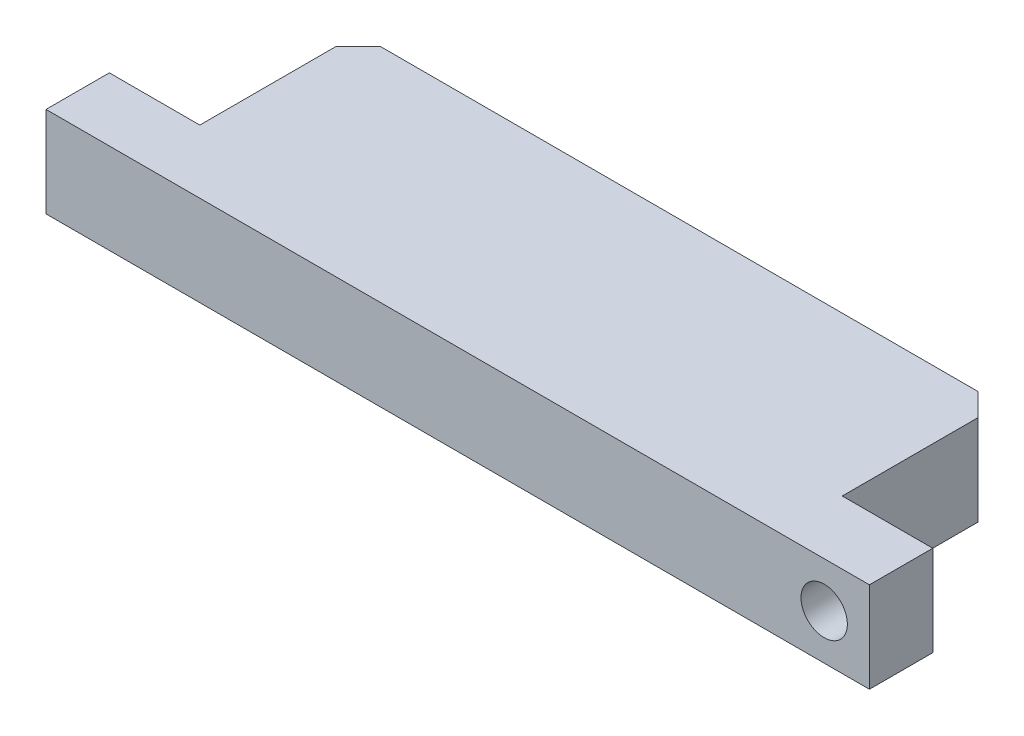
ISO-10303-21;
HEADER;
FILE_DESCRIPTION(('STEP AP214'),'2;1');
FILE_NAME('part.step','',(''),(''),'','','');
FILE_SCHEMA(('AUTOMOTIVE_DESIGN { 1 0 10303 214 1 1 1 1 }'));
ENDSEC;
DATA;
#1=APPLICATION_CONTEXT('core data for automotive mechanical design processes');
#2=APPLICATION_PROTOCOL_DEFINITION('international standard','automotive_design',2000,#1);
#3=PRODUCT_CONTEXT('',#1,'mechanical');
#4=PRODUCT('Part','Part','',(#3));
#5=PRODUCT_RELATED_PRODUCT_CATEGORY('part','',(#4));
#6=PRODUCT_DEFINITION_FORMATION('','',#4);
#7=PRODUCT_DEFINITION_CONTEXT('part definition',#1,'design');
#8=PRODUCT_DEFINITION('design','',#6,#7);
#9=PRODUCT_DEFINITION_SHAPE('','',#8);
#10=(LENGTH_UNIT() NAMED_UNIT(*) SI_UNIT(.MILLI.,.METRE.));
#11=(NAMED_UNIT(*) PLANE_ANGLE_UNIT() SI_UNIT($,.RADIAN.));
#12=(NAMED_UNIT(*) SI_UNIT($,.STERADIAN.) SOLID_ANGLE_UNIT());
#13=UNCERTAINTY_MEASURE_WITH_UNIT(LENGTH_MEASURE(1.E-05),#10,'distance_accuracy_value','');
#14=(GEOMETRIC_REPRESENTATION_CONTEXT(3) GLOBAL_UNCERTAINTY_ASSIGNED_CONTEXT((#13)) GLOBAL_UNIT_ASSIGNED_CONTEXT((#10,
#11,#12)) REPRESENTATION_CONTEXT('',''));
#15=CARTESIAN_POINT('',(0.,0.,0.));
#16=DIRECTION('',(0.,0.,1.));
#17=DIRECTION('',(1.,0.,0.));
#18=AXIS2_PLACEMENT_3D('',#15,#16,#17);
#19=CARTESIAN_POINT('',(18.2,0.,9.8));
#20=DIRECTION('',(1.,0.,0.));
#21=DIRECTION('',(0.,0.,-1.));
#22=AXIS2_PLACEMENT_3D('',#19,#20,#21);
#23=PLANE('',#22);
#24=DIRECTION('',(0.,-1.,0.));
#25=VECTOR('',#24,1.);
#26=CARTESIAN_POINT('',(18.2,4.,6.9999999993));
#27=LINE('',#26,#25);
#28=CARTESIAN_POINT('',(18.2,4.,6.9999999993));
#29=VERTEX_POINT('',#28);
#30=CARTESIAN_POINT('',(18.2,0.,6.9999999993));
#31=VERTEX_POINT('',#30);
#32=EDGE_CURVE('E144',#29,#31,#27,.T.);
#33=ORIENTED_EDGE('',*,*,#32,.F.);
#34=DIRECTION('',(0.,0.,-1.));
#35=VECTOR('',#34,1.);
#36=CARTESIAN_POINT('',(18.2,4.,9.8));
#37=LINE('',#36,#35);
#38=CARTESIAN_POINT('',(18.2,4.,9.8));
#39=VERTEX_POINT('',#38);
#40=EDGE_CURVE('E164',#39,#29,#37,.T.);
#41=ORIENTED_EDGE('',*,*,#40,.F.);
#42=DIRECTION('',(0.,1.,0.));
#43=VECTOR('',#42,1.);
#44=CARTESIAN_POINT('',(18.2,0.,9.8));
#45=LINE('',#44,#43);
#46=CARTESIAN_POINT('',(18.2,0.,9.8));
#47=VERTEX_POINT('',#46);
#48=EDGE_CURVE('E187',#47,#39,#45,.T.);
#49=ORIENTED_EDGE('',*,*,#48,.F.);
#50=DIRECTION('',(0.,0.,-1.));
#51=VECTOR('',#50,1.);
#52=CARTESIAN_POINT('',(18.2,0.,9.8));
#53=LINE('',#52,#51);
#54=EDGE_CURVE('E167',#47,#31,#53,.T.);
#55=ORIENTED_EDGE('',*,*,#54,.T.);
#56=EDGE_LOOP('',(#33,#41,#49,#55));
#57=FACE_BOUND('',#56,.T.);
#58=ADVANCED_FACE('F32',(#57),#23,.T.);
#59=CARTESIAN_POINT('',(-18.2,0.,9.8));
#60=DIRECTION('',(0.,0.,1.));
#61=DIRECTION('',(1.,0.,0.));
#62=AXIS2_PLACEMENT_3D('',#59,#60,#61);
#63=PLANE('',#62);
#64=CARTESIAN_POINT('',(16.2,2.,9.8));
#65=DIRECTION('',(0.,0.,1.));
#66=DIRECTION('',(1.,0.,0.));
#67=AXIS2_PLACEMENT_3D('',#64,#65,#66);
#68=CIRCLE('',#67,1.02499999999998);
#69=CARTESIAN_POINT('',(17.225,2.,9.8));
#70=VERTEX_POINT('',#69);
#71=EDGE_CURVE('E289',#70,#70,#68,.T.);
#72=ORIENTED_EDGE('',*,*,#71,.F.);
#73=EDGE_LOOP('',(#72));
#74=FACE_BOUND('',#73,.T.);
#75=DIRECTION('',(1.,0.,0.));
#76=VECTOR('',#75,1.);
#77=CARTESIAN_POINT('',(-18.2,4.,9.8));
#78=LINE('',#77,#76);
#79=CARTESIAN_POINT('',(-18.2,4.,9.8));
#80=VERTEX_POINT('',#79);
#81=EDGE_CURVE('E171',#80,#39,#78,.T.);
#82=ORIENTED_EDGE('',*,*,#81,.F.);
#83=DIRECTION('',(0.,1.,0.));
#84=VECTOR('',#83,1.);
#85=CARTESIAN_POINT('',(-18.2,0.,9.8));
#86=LINE('',#85,#84);
#87=CARTESIAN_POINT('',(-18.2,0.,9.8));
#88=VERTEX_POINT('',#87);
#89=EDGE_CURVE('E178',#88,#80,#86,.T.);
#90=ORIENTED_EDGE('',*,*,#89,.F.);
#91=DIRECTION('',(1.,0.,0.));
#92=VECTOR('',#91,1.);
#93=CARTESIAN_POINT('',(-18.2,0.,9.8));
#94=LINE('',#93,#92);
#95=EDGE_CURVE('E175',#88,#47,#94,.T.);
#96=ORIENTED_EDGE('',*,*,#95,.T.);
#97=ORIENTED_EDGE('',*,*,#48,.T.);
#98=EDGE_LOOP('',(#82,#90,#96,#97));
#99=FACE_BOUND('',#98,.T.);
#100=ADVANCED_FACE('F236',(#74,#99),#63,.T.);
#101=CARTESIAN_POINT('',(-18.2,0.,0.));
#102=DIRECTION('',(-1.,0.,0.));
#103=DIRECTION('',(0.,0.,1.));
#104=AXIS2_PLACEMENT_3D('',#101,#102,#103);
#105=PLANE('',#104);
#106=DIRECTION('',(0.,-1.,0.));
#107=VECTOR('',#106,1.);
#108=CARTESIAN_POINT('',(-18.2,4.,6.9999999993));
#109=LINE('',#108,#107);
#110=CARTESIAN_POINT('',(-18.2,4.,6.9999999993));
#111=VERTEX_POINT('',#110);
#112=CARTESIAN_POINT('',(-18.2,0.,6.9999999993));
#113=VERTEX_POINT('',#112);
#114=EDGE_CURVE('E161',#111,#113,#109,.T.);
#115=ORIENTED_EDGE('',*,*,#114,.T.);
#116=DIRECTION('',(0.,0.,1.));
#117=VECTOR('',#116,1.);
#118=CARTESIAN_POINT('',(-18.2,0.,0.));
#119=LINE('',#118,#117);
#120=EDGE_CURVE('E173',#113,#88,#119,.T.);
#121=ORIENTED_EDGE('',*,*,#120,.T.);
#122=ORIENTED_EDGE('',*,*,#89,.T.);
#123=DIRECTION('',(0.,0.,1.));
#124=VECTOR('',#123,1.);
#125=CARTESIAN_POINT('',(-18.2,4.,0.));
#126=LINE('',#125,#124);
#127=EDGE_CURVE('E183',#111,#80,#126,.T.);
#128=ORIENTED_EDGE('',*,*,#127,.F.);
#129=EDGE_LOOP('',(#115,#121,#122,#128));
#130=FACE_BOUND('',#129,.T.);
#131=ADVANCED_FACE('F240',(#130),#105,.T.);
#132=CARTESIAN_POINT('',(18.2,0.,0.));
#133=DIRECTION('',(0.,0.,-1.));
#134=DIRECTION('',(-1.,0.,0.));
#135=AXIS2_PLACEMENT_3D('',#132,#133,#134);
#136=PLANE('',#135);
#137=CARTESIAN_POINT('',(-10.,2.,0.));
#138=DIRECTION('',(0.,0.,-1.));
#139=DIRECTION('',(-1.,0.,0.));
#140=AXIS2_PLACEMENT_3D('',#137,#138,#139);
#141=CIRCLE('',#140,1.02499999999999);
#142=CARTESIAN_POINT('',(-11.025,2.,0.));
#143=VERTEX_POINT('',#142);
#144=EDGE_CURVE('E125',#143,#143,#141,.T.);
#145=ORIENTED_EDGE('',*,*,#144,.F.);
#146=EDGE_LOOP('',(#145));
#147=FACE_BOUND('',#146,.T.);
#148=CARTESIAN_POINT('',(10.,2.,0.));
#149=DIRECTION('',(0.,0.,-1.));
#150=DIRECTION('',(-1.,0.,0.));
#151=AXIS2_PLACEMENT_3D('',#148,#149,#150);
#152=CIRCLE('',#151,1.02499999999999);
#153=CARTESIAN_POINT('',(8.97500000000001,2.,0.));
#154=VERTEX_POINT('',#153);
#155=EDGE_CURVE('E124',#154,#154,#152,.T.);
#156=ORIENTED_EDGE('',*,*,#155,.F.);
#157=EDGE_LOOP('',(#156));
#158=FACE_BOUND('',#157,.T.);
#159=DIRECTION('',(-1.,0.,0.));
#160=VECTOR('',#159,1.);
#161=CARTESIAN_POINT('',(18.2,0.,0.));
#162=LINE('',#161,#160);
#163=CARTESIAN_POINT('',(13.2,0.,0.));
#164=VERTEX_POINT('',#163);
#165=CARTESIAN_POINT('',(-13.2,0.,0.));
#166=VERTEX_POINT('',#165);
#167=EDGE_CURVE('E170',#164,#166,#162,.T.);
#168=ORIENTED_EDGE('',*,*,#167,.T.);
#169=DIRECTION('',(0.,1.,0.));
#170=VECTOR('',#169,1.);
#171=CARTESIAN_POINT('',(-13.2,4.,0.));
#172=LINE('',#171,#170);
#173=CARTESIAN_POINT('',(-13.2,4.,0.));
#174=VERTEX_POINT('',#173);
#175=EDGE_CURVE('E53',#166,#174,#172,.T.);
#176=ORIENTED_EDGE('',*,*,#175,.T.);
#177=DIRECTION('',(-1.,0.,0.));
#178=VECTOR('',#177,1.);
#179=CARTESIAN_POINT('',(18.2,4.,0.));
#180=LINE('',#179,#178);
#181=CARTESIAN_POINT('',(13.2,4.,0.));
#182=VERTEX_POINT('',#181);
#183=EDGE_CURVE('E181',#182,#174,#180,.T.);
#184=ORIENTED_EDGE('',*,*,#183,.F.);
#185=DIRECTION('',(0.,-1.,0.));
#186=VECTOR('',#185,1.);
#187=CARTESIAN_POINT('',(13.2,0.,0.));
#188=LINE('',#187,#186);
#189=EDGE_CURVE('E198',#182,#164,#188,.T.);
#190=ORIENTED_EDGE('',*,*,#189,.T.);
#191=EDGE_LOOP('',(#168,#176,#184,#190));
#192=FACE_BOUND('',#191,.T.);
#193=ADVANCED_FACE('F219',(#147,#158,#192),#136,.T.);
#194=CARTESIAN_POINT('',(0.,0.,0.));
#195=DIRECTION('',(0.,1.,0.));
#196=DIRECTION('',(0.,0.,1.));
#197=AXIS2_PLACEMENT_3D('',#194,#195,#196);
#198=PLANE('',#197);
#199=DIRECTION('',(0.,0.,1.));
#200=VECTOR('',#199,1.);
#201=CARTESIAN_POINT('',(-14.2,0.,0.));
#202=LINE('',#201,#200);
#203=CARTESIAN_POINT('',(-14.2,0.,0.999999999999997));
#204=VERTEX_POINT('',#203);
#205=CARTESIAN_POINT('',(-14.2,0.,6.9999999993));
#206=VERTEX_POINT('',#205);
#207=EDGE_CURVE('E150',#204,#206,#202,.T.);
#208=ORIENTED_EDGE('',*,*,#207,.F.);
#209=DIRECTION('',(0.70710678118655,0.,-0.707106781186545));
#210=VECTOR('',#209,1.);
#211=CARTESIAN_POINT('',(-14.2,0.,0.999999999999997));
#212=LINE('',#211,#210);
#213=EDGE_CURVE('E196',#204,#166,#212,.T.);
#214=ORIENTED_EDGE('',*,*,#213,.T.);
#215=ORIENTED_EDGE('',*,*,#167,.F.);
#216=DIRECTION('',(0.707106781186545,0.,0.70710678118655));
#217=VECTOR('',#216,1.);
#218=CARTESIAN_POINT('',(13.2,0.,0.));
#219=LINE('',#218,#217);
#220=CARTESIAN_POINT('',(14.2,0.,1.));
#221=VERTEX_POINT('',#220);
#222=EDGE_CURVE('E194',#164,#221,#219,.T.);
#223=ORIENTED_EDGE('',*,*,#222,.T.);
#224=DIRECTION('',(0.,0.,-1.));
#225=VECTOR('',#224,1.);
#226=CARTESIAN_POINT('',(14.2,0.,6.9999999993));
#227=LINE('',#226,#225);
#228=CARTESIAN_POINT('',(14.2,0.,6.9999999993));
#229=VERTEX_POINT('',#228);
#230=EDGE_CURVE('E142',#229,#221,#227,.T.);
#231=ORIENTED_EDGE('',*,*,#230,.F.);
#232=DIRECTION('',(-1.,0.,0.));
#233=VECTOR('',#232,1.);
#234=CARTESIAN_POINT('',(18.2,0.,6.9999999993));
#235=LINE('',#234,#233);
#236=EDGE_CURVE('E137',#31,#229,#235,.T.);
#237=ORIENTED_EDGE('',*,*,#236,.F.);
#238=ORIENTED_EDGE('',*,*,#54,.F.);
#239=ORIENTED_EDGE('',*,*,#95,.F.);
#240=ORIENTED_EDGE('',*,*,#120,.F.);
#241=DIRECTION('',(-1.,0.,0.));
#242=VECTOR('',#241,1.);
#243=CARTESIAN_POINT('',(-14.2,0.,6.9999999993));
#244=LINE('',#243,#242);
#245=EDGE_CURVE('E155',#206,#113,#244,.T.);
#246=ORIENTED_EDGE('',*,*,#245,.F.);
#247=EDGE_LOOP('',(#208,#214,#215,#223,#231,#237,#238,#239,#240,#246));
#248=FACE_BOUND('',#247,.T.);
#249=ADVANCED_FACE('F217',(#248),#198,.F.);
#250=CARTESIAN_POINT('',(0.,4.,0.));
#251=DIRECTION('',(0.,1.,0.));
#252=DIRECTION('',(0.,0.,1.));
#253=AXIS2_PLACEMENT_3D('',#250,#251,#252);
#254=PLANE('',#253);
#255=ORIENTED_EDGE('',*,*,#183,.T.);
#256=DIRECTION('',(-0.70710678118655,0.,0.707106781186545));
#257=VECTOR('',#256,1.);
#258=CARTESIAN_POINT('',(-6.59999999999995,4.,-6.6));
#259=LINE('',#258,#257);
#260=CARTESIAN_POINT('',(-14.2,4.,0.999999999999999));
#261=VERTEX_POINT('',#260);
#262=EDGE_CURVE('E40',#174,#261,#259,.T.);
#263=ORIENTED_EDGE('',*,*,#262,.T.);
#264=DIRECTION('',(0.,0.,1.));
#265=VECTOR('',#264,1.);
#266=CARTESIAN_POINT('',(-14.2,4.,0.));
#267=LINE('',#266,#265);
#268=CARTESIAN_POINT('',(-14.2,4.,6.9999999993));
#269=VERTEX_POINT('',#268);
#270=EDGE_CURVE('E152',#261,#269,#267,.T.);
#271=ORIENTED_EDGE('',*,*,#270,.T.);
#272=DIRECTION('',(-1.,0.,0.));
#273=VECTOR('',#272,1.);
#274=CARTESIAN_POINT('',(-14.2,4.,6.9999999993));
#275=LINE('',#274,#273);
#276=EDGE_CURVE('E154',#269,#111,#275,.T.);
#277=ORIENTED_EDGE('',*,*,#276,.T.);
#278=ORIENTED_EDGE('',*,*,#127,.T.);
#279=ORIENTED_EDGE('',*,*,#81,.T.);
#280=ORIENTED_EDGE('',*,*,#40,.T.);
#281=DIRECTION('',(-1.,0.,0.));
#282=VECTOR('',#281,1.);
#283=CARTESIAN_POINT('',(18.2,4.,6.9999999993));
#284=LINE('',#283,#282);
#285=CARTESIAN_POINT('',(14.2,4.,6.9999999993));
#286=VERTEX_POINT('',#285);
#287=EDGE_CURVE('E138',#29,#286,#284,.T.);
#288=ORIENTED_EDGE('',*,*,#287,.T.);
#289=DIRECTION('',(0.,0.,-1.));
#290=VECTOR('',#289,1.);
#291=CARTESIAN_POINT('',(14.2,4.,6.9999999993));
#292=LINE('',#291,#290);
#293=CARTESIAN_POINT('',(14.2,4.,1.00000000000001));
#294=VERTEX_POINT('',#293);
#295=EDGE_CURVE('E141',#286,#294,#292,.T.);
#296=ORIENTED_EDGE('',*,*,#295,.T.);
#297=DIRECTION('',(-0.707106781186545,0.,-0.70710678118655));
#298=VECTOR('',#297,1.);
#299=CARTESIAN_POINT('',(6.60000000000005,4.,-6.6));
#300=LINE('',#299,#298);
#301=EDGE_CURVE('E202',#294,#182,#300,.T.);
#302=ORIENTED_EDGE('',*,*,#301,.T.);
#303=EDGE_LOOP('',(#255,#263,#271,#277,#278,#279,#280,#288,#296,#302));
#304=FACE_BOUND('',#303,.T.);
#305=ADVANCED_FACE('F206',(#304),#254,.T.);
#306=CARTESIAN_POINT('',(-14.2,4.,0.));
#307=DIRECTION('',(1.,0.,0.));
#308=DIRECTION('',(0.,0.,-1.));
#309=AXIS2_PLACEMENT_3D('',#306,#307,#308);
#310=PLANE('',#309);
#311=ORIENTED_EDGE('',*,*,#270,.F.);
#312=DIRECTION('',(0.,-1.,0.));
#313=VECTOR('',#312,1.);
#314=CARTESIAN_POINT('',(-14.2,0.,0.999999999999997));
#315=LINE('',#314,#313);
#316=EDGE_CURVE('E189',#261,#204,#315,.T.);
#317=ORIENTED_EDGE('',*,*,#316,.T.);
#318=ORIENTED_EDGE('',*,*,#207,.T.);
#319=DIRECTION('',(0.,-1.,0.));
#320=VECTOR('',#319,1.);
#321=CARTESIAN_POINT('',(-14.2,4.,6.9999999993));
#322=LINE('',#321,#320);
#323=EDGE_CURVE('E158',#269,#206,#322,.T.);
#324=ORIENTED_EDGE('',*,*,#323,.F.);
#325=EDGE_LOOP('',(#311,#317,#318,#324));
#326=FACE_BOUND('',#325,.T.);
#327=ADVANCED_FACE('F211',(#326),#310,.F.);
#328=CARTESIAN_POINT('',(-14.2,4.,6.9999999993));
#329=DIRECTION('',(0.,0.,1.));
#330=DIRECTION('',(1.,0.,0.));
#331=AXIS2_PLACEMENT_3D('',#328,#329,#330);
#332=PLANE('',#331);
#333=ORIENTED_EDGE('',*,*,#245,.T.);
#334=ORIENTED_EDGE('',*,*,#114,.F.);
#335=ORIENTED_EDGE('',*,*,#276,.F.);
#336=ORIENTED_EDGE('',*,*,#323,.T.);
#337=EDGE_LOOP('',(#333,#334,#335,#336));
#338=FACE_BOUND('',#337,.T.);
#339=ADVANCED_FACE('F243',(#338),#332,.F.);
#340=CARTESIAN_POINT('',(14.2,4.,6.9999999993));
#341=DIRECTION('',(-1.,0.,0.));
#342=DIRECTION('',(0.,0.,1.));
#343=AXIS2_PLACEMENT_3D('',#340,#341,#342);
#344=PLANE('',#343);
#345=ORIENTED_EDGE('',*,*,#230,.T.);
#346=DIRECTION('',(0.,1.,0.));
#347=VECTOR('',#346,1.);
#348=CARTESIAN_POINT('',(14.2,4.,1.));
#349=LINE('',#348,#347);
#350=EDGE_CURVE('E11',#221,#294,#349,.T.);
#351=ORIENTED_EDGE('',*,*,#350,.T.);
#352=ORIENTED_EDGE('',*,*,#295,.F.);
#353=DIRECTION('',(0.,-1.,0.));
#354=VECTOR('',#353,1.);
#355=CARTESIAN_POINT('',(14.2,4.,6.9999999993));
#356=LINE('',#355,#354);
#357=EDGE_CURVE('E148',#286,#229,#356,.T.);
#358=ORIENTED_EDGE('',*,*,#357,.T.);
#359=EDGE_LOOP('',(#345,#351,#352,#358));
#360=FACE_BOUND('',#359,.T.);
#361=ADVANCED_FACE('F225',(#360),#344,.F.);
#362=CARTESIAN_POINT('',(18.2,4.,6.9999999993));
#363=DIRECTION('',(0.,0.,1.));
#364=DIRECTION('',(1.,0.,0.));
#365=AXIS2_PLACEMENT_3D('',#362,#363,#364);
#366=PLANE('',#365);
#367=CARTESIAN_POINT('',(16.2,2.,6.9999999993));
#368=DIRECTION('',(0.,0.,1.));
#369=DIRECTION('',(1.,0.,0.));
#370=AXIS2_PLACEMENT_3D('',#367,#368,#369);
#371=CIRCLE('',#370,1.02499999999998);
#372=CARTESIAN_POINT('',(17.225,2.,6.9999999993));
#373=VERTEX_POINT('',#372);
#374=EDGE_CURVE('E131',#373,#373,#371,.T.);
#375=ORIENTED_EDGE('',*,*,#374,.T.);
#376=EDGE_LOOP('',(#375));
#377=FACE_BOUND('',#376,.T.);
#378=ORIENTED_EDGE('',*,*,#236,.T.);
#379=ORIENTED_EDGE('',*,*,#357,.F.);
#380=ORIENTED_EDGE('',*,*,#287,.F.);
#381=ORIENTED_EDGE('',*,*,#32,.T.);
#382=EDGE_LOOP('',(#378,#379,#380,#381));
#383=FACE_BOUND('',#382,.T.);
#384=ADVANCED_FACE('F228',(#377,#383),#366,.F.);
#385=CARTESIAN_POINT('',(10.,2.,6.34999999999999));
#386=DIRECTION('',(0.,0.,-1.));
#387=DIRECTION('',(-1.,0.,0.));
#388=AXIS2_PLACEMENT_3D('',#385,#386,#387);
#389=CONICAL_SURFACE('',#388,1.02499999999999,1.02974425832057);
#390=CARTESIAN_POINT('',(10.,2.,6.96588213499999));
#391=VERTEX_POINT('',#390);
#392=VERTEX_LOOP('',#391);
#393=FACE_BOUND('',#392,.T.);
#394=CARTESIAN_POINT('',(10.,2.,6.34999999999999));
#395=DIRECTION('',(0.,0.,-1.));
#396=DIRECTION('',(-1.,0.,0.));
#397=AXIS2_PLACEMENT_3D('',#394,#395,#396);
#398=CIRCLE('',#397,1.02499999999999);
#399=CARTESIAN_POINT('',(8.97500000000001,2.,6.34999999999999));
#400=VERTEX_POINT('',#399);
#401=EDGE_CURVE('E128',#400,#400,#398,.T.);
#402=ORIENTED_EDGE('',*,*,#401,.T.);
#403=EDGE_LOOP('',(#402));
#404=FACE_BOUND('',#403,.T.);
#405=ADVANCED_FACE('F279',(#393,#404),#389,.F.);
#406=CARTESIAN_POINT('',(10.,2.,0.));
#407=DIRECTION('',(0.,0.,-1.));
#408=DIRECTION('',(-1.,0.,0.));
#409=AXIS2_PLACEMENT_3D('',#406,#407,#408);
#410=CYLINDRICAL_SURFACE('',#409,1.02499999999999);
#411=ORIENTED_EDGE('',*,*,#401,.F.);
#412=EDGE_LOOP('',(#411));
#413=FACE_BOUND('',#412,.T.);
#414=ORIENTED_EDGE('',*,*,#155,.T.);
#415=EDGE_LOOP('',(#414));
#416=FACE_BOUND('',#415,.T.);
#417=ADVANCED_FACE('F118',(#413,#416),#410,.F.);
#418=CARTESIAN_POINT('',(-10.,2.,6.34999999999999));
#419=DIRECTION('',(0.,0.,-1.));
#420=DIRECTION('',(-1.,0.,0.));
#421=AXIS2_PLACEMENT_3D('',#418,#419,#420);
#422=CONICAL_SURFACE('',#421,1.02499999999999,1.02974425832057);
#423=CARTESIAN_POINT('',(-10.,2.,6.96588213499999));
#424=VERTEX_POINT('',#423);
#425=VERTEX_LOOP('',#424);
#426=FACE_BOUND('',#425,.T.);
#427=CARTESIAN_POINT('',(-10.,2.,6.34999999999999));
#428=DIRECTION('',(0.,0.,-1.));
#429=DIRECTION('',(-1.,0.,0.));
#430=AXIS2_PLACEMENT_3D('',#427,#428,#429);
#431=CIRCLE('',#430,1.02499999999999);
#432=CARTESIAN_POINT('',(-11.025,2.,6.34999999999999));
#433=VERTEX_POINT('',#432);
#434=EDGE_CURVE('E122',#433,#433,#431,.T.);
#435=ORIENTED_EDGE('',*,*,#434,.T.);
#436=EDGE_LOOP('',(#435));
#437=FACE_BOUND('',#436,.T.);
#438=ADVANCED_FACE('F114',(#426,#437),#422,.F.);
#439=CARTESIAN_POINT('',(-10.,2.,0.));
#440=DIRECTION('',(0.,0.,-1.));
#441=DIRECTION('',(-1.,0.,0.));
#442=AXIS2_PLACEMENT_3D('',#439,#440,#441);
#443=CYLINDRICAL_SURFACE('',#442,1.02499999999999);
#444=ORIENTED_EDGE('',*,*,#434,.F.);
#445=EDGE_LOOP('',(#444));
#446=FACE_BOUND('',#445,.T.);
#447=ORIENTED_EDGE('',*,*,#144,.T.);
#448=EDGE_LOOP('',(#447));
#449=FACE_BOUND('',#448,.T.);
#450=ADVANCED_FACE('F117',(#446,#449),#443,.F.);
#451=CARTESIAN_POINT('',(16.2,2.,9.8));
#452=DIRECTION('',(0.,0.,1.));
#453=DIRECTION('',(1.,0.,0.));
#454=AXIS2_PLACEMENT_3D('',#451,#452,#453);
#455=CYLINDRICAL_SURFACE('',#454,1.02499999999998);
#456=ORIENTED_EDGE('',*,*,#71,.T.);
#457=EDGE_LOOP('',(#456));
#458=FACE_BOUND('',#457,.T.);
#459=ORIENTED_EDGE('',*,*,#374,.F.);
#460=EDGE_LOOP('',(#459));
#461=FACE_BOUND('',#460,.T.);
#462=ADVANCED_FACE('F263',(#458,#461),#455,.F.);
#463=CARTESIAN_POINT('',(-14.2,4.,0.999999999999997));
#464=DIRECTION('',(-0.707106781186545,0.,-0.70710678118655));
#465=DIRECTION('',(0.,1.,0.));
#466=AXIS2_PLACEMENT_3D('',#463,#464,#465);
#467=PLANE('',#466);
#468=ORIENTED_EDGE('',*,*,#262,.F.);
#469=ORIENTED_EDGE('',*,*,#175,.F.);
#470=ORIENTED_EDGE('',*,*,#213,.F.);
#471=ORIENTED_EDGE('',*,*,#316,.F.);
#472=EDGE_LOOP('',(#468,#469,#470,#471));
#473=FACE_BOUND('',#472,.T.);
#474=ADVANCED_FACE('F214',(#473),#467,.T.);
#475=CARTESIAN_POINT('',(13.2,0.,0.));
#476=DIRECTION('',(0.70710678118655,0.,-0.707106781186545));
#477=DIRECTION('',(0.,1.,0.));
#478=AXIS2_PLACEMENT_3D('',#475,#476,#477);
#479=PLANE('',#478);
#480=ORIENTED_EDGE('',*,*,#301,.F.);
#481=ORIENTED_EDGE('',*,*,#350,.F.);
#482=ORIENTED_EDGE('',*,*,#222,.F.);
#483=ORIENTED_EDGE('',*,*,#189,.F.);
#484=EDGE_LOOP('',(#480,#481,#482,#483));
#485=FACE_BOUND('',#484,.T.);
#486=ADVANCED_FACE('F34',(#485),#479,.T.);
#487=CLOSED_SHELL('',(#58,#100,#131,#193,#249,#305,#327,#339,#361,#384,#405,#417,#438,#450,#462,
#474,#486));
#488=MANIFOLD_SOLID_BREP('B2',#487);
#489=ADVANCED_BREP_SHAPE_REPRESENTATION('',(#18,#488),#14);
#490=SHAPE_DEFINITION_REPRESENTATION(#9,#489);
ENDSEC;
END-ISO-10303-21;
